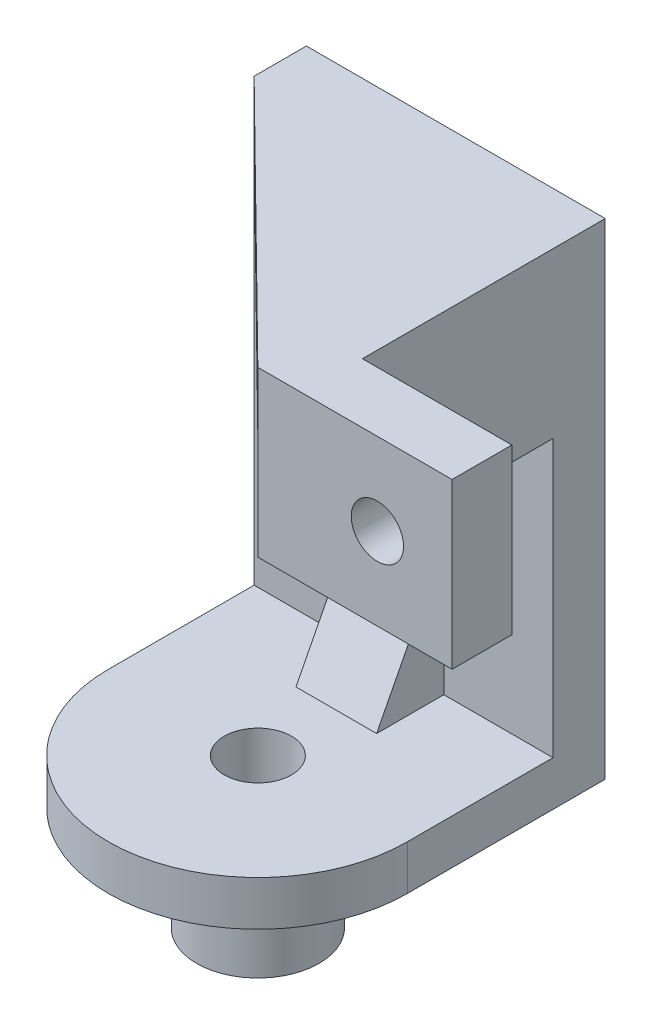
ISO-10303-21;
HEADER;
FILE_DESCRIPTION(('STEP AP214'),'2;1');
FILE_NAME('part.step','',(''),(''),'','','');
FILE_SCHEMA(('AUTOMOTIVE_DESIGN { 1 0 10303 214 1 1 1 1 }'));
ENDSEC;
DATA;
#1=APPLICATION_CONTEXT('core data for automotive mechanical design processes');
#2=APPLICATION_PROTOCOL_DEFINITION('international standard','automotive_design',2000,#1);
#3=PRODUCT_CONTEXT('',#1,'mechanical');
#4=PRODUCT('Part','Part','',(#3));
#5=PRODUCT_RELATED_PRODUCT_CATEGORY('part','',(#4));
#6=PRODUCT_DEFINITION_FORMATION('','',#4);
#7=PRODUCT_DEFINITION_CONTEXT('part definition',#1,'design');
#8=PRODUCT_DEFINITION('design','',#6,#7);
#9=PRODUCT_DEFINITION_SHAPE('','',#8);
#10=(LENGTH_UNIT() NAMED_UNIT(*) SI_UNIT(.MILLI.,.METRE.));
#11=(NAMED_UNIT(*) PLANE_ANGLE_UNIT() SI_UNIT($,.RADIAN.));
#12=(NAMED_UNIT(*) SI_UNIT($,.STERADIAN.) SOLID_ANGLE_UNIT());
#13=UNCERTAINTY_MEASURE_WITH_UNIT(LENGTH_MEASURE(1.E-05),#10,'distance_accuracy_value','');
#14=(GEOMETRIC_REPRESENTATION_CONTEXT(3) GLOBAL_UNCERTAINTY_ASSIGNED_CONTEXT((#13)) GLOBAL_UNIT_ASSIGNED_CONTEXT((#10,
#11,#12)) REPRESENTATION_CONTEXT('',''));
#15=CARTESIAN_POINT('',(0.,0.,0.));
#16=DIRECTION('',(0.,0.,1.));
#17=DIRECTION('',(1.,0.,0.));
#18=AXIS2_PLACEMENT_3D('',#15,#16,#17);
#19=CARTESIAN_POINT('',(1.28402573287201,28.,-15.9459750219353));
#20=DIRECTION('',(0.,0.,-1.));
#21=DIRECTION('',(-1.,0.,0.));
#22=AXIS2_PLACEMENT_3D('',#19,#20,#21);
#23=PLANE('',#22);
#24=CARTESIAN_POINT('',(-8.71597426712799,23.,-15.9459750219353));
#25=DIRECTION('',(0.,0.,-1.));
#26=DIRECTION('',(-1.,0.,0.));
#27=AXIS2_PLACEMENT_3D('',#24,#25,#26);
#28=CIRCLE('',#27,2.25);
#29=CARTESIAN_POINT('',(-10.965974267128,23.,-15.9459750219353));
#30=VERTEX_POINT('',#29);
#31=EDGE_CURVE('E224',#30,#30,#28,.T.);
#32=ORIENTED_EDGE('',*,*,#31,.T.);
#33=EDGE_LOOP('',(#32));
#34=FACE_BOUND('',#33,.T.);
#35=DIRECTION('',(1.,0.,0.));
#36=VECTOR('',#35,1.);
#37=CARTESIAN_POINT('',(1.28402573287201,28.5,-15.9459750219353));
#38=LINE('',#37,#36);
#39=CARTESIAN_POINT('',(-18.715974267128,28.5,-15.9459750219353));
#40=VERTEX_POINT('',#39);
#41=CARTESIAN_POINT('',(-1.71597426712799,28.5,-15.9459750219353));
#42=VERTEX_POINT('',#41);
#43=EDGE_CURVE('E166',#40,#42,#38,.T.);
#44=ORIENTED_EDGE('',*,*,#43,.F.);
#45=DIRECTION('',(0.,-1.,0.));
#46=VECTOR('',#45,1.);
#47=CARTESIAN_POINT('',(-18.715974267128,28.,-15.9459750219353));
#48=LINE('',#47,#46);
#49=CARTESIAN_POINT('',(-18.715974267128,3.,-15.9459750219353));
#50=VERTEX_POINT('',#49);
#51=EDGE_CURVE('E161',#40,#50,#48,.T.);
#52=ORIENTED_EDGE('',*,*,#51,.T.);
#53=DIRECTION('',(1.,0.,0.));
#54=VECTOR('',#53,1.);
#55=CARTESIAN_POINT('',(1.28402573287201,3.,-15.9459750219353));
#56=LINE('',#55,#54);
#57=CARTESIAN_POINT('',(-11.415974267128,3.,-15.9459750219353));
#58=VERTEX_POINT('',#57);
#59=EDGE_CURVE('E182',#50,#58,#56,.T.);
#60=ORIENTED_EDGE('',*,*,#59,.T.);
#61=DIRECTION('',(0.,1.,0.));
#62=VECTOR('',#61,1.);
#63=CARTESIAN_POINT('',(-11.415974267128,28.,-15.9459750219353));
#64=LINE('',#63,#62);
#65=CARTESIAN_POINT('',(-11.415974267128,11.75,-15.9459750219353));
#66=VERTEX_POINT('',#65);
#67=EDGE_CURVE('E319',#58,#66,#64,.T.);
#68=ORIENTED_EDGE('',*,*,#67,.T.);
#69=DIRECTION('',(-1.,0.,0.));
#70=VECTOR('',#69,1.);
#71=CARTESIAN_POINT('',(1.28402573287201,11.75,-15.9459750219353));
#72=LINE('',#71,#70);
#73=CARTESIAN_POINT('',(-6.01597426712799,11.75,-15.9459750219353));
#74=VERTEX_POINT('',#73);
#75=EDGE_CURVE('E243',#66,#74,#72,.F.);
#76=ORIENTED_EDGE('',*,*,#75,.T.);
#77=DIRECTION('',(0.,1.,0.));
#78=VECTOR('',#77,1.);
#79=CARTESIAN_POINT('',(-6.01597426712799,28.,-15.9459750219353));
#80=LINE('',#79,#78);
#81=CARTESIAN_POINT('',(-6.01597426712799,3.,-15.9459750219353));
#82=VERTEX_POINT('',#81);
#83=EDGE_CURVE('E259',#82,#74,#80,.T.);
#84=ORIENTED_EDGE('',*,*,#83,.F.);
#85=CARTESIAN_POINT('',(1.28402573287201,3.,-15.9459750219353));
#86=VERTEX_POINT('',#85);
#87=EDGE_CURVE('E249',#82,#86,#56,.T.);
#88=ORIENTED_EDGE('',*,*,#87,.T.);
#89=DIRECTION('',(0.,-1.,0.));
#90=VECTOR('',#89,1.);
#91=CARTESIAN_POINT('',(1.28402573287201,28.,-15.9459750219353));
#92=LINE('',#91,#90);
#93=CARTESIAN_POINT('',(1.28402573287201,21.5,-15.9459750219353));
#94=VERTEX_POINT('',#93);
#95=EDGE_CURVE('E180',#94,#86,#92,.T.);
#96=ORIENTED_EDGE('',*,*,#95,.F.);
#97=DIRECTION('',(1.,0.,0.));
#98=VECTOR('',#97,1.);
#99=CARTESIAN_POINT('',(1.28402573287201,21.5,-15.9459750219353));
#100=LINE('',#99,#98);
#101=CARTESIAN_POINT('',(-1.71597426712799,21.5,-15.9459750219353));
#102=VERTEX_POINT('',#101);
#103=EDGE_CURVE('E448',#102,#94,#100,.T.);
#104=ORIENTED_EDGE('',*,*,#103,.F.);
#105=DIRECTION('',(0.,-1.,0.));
#106=VECTOR('',#105,1.);
#107=CARTESIAN_POINT('',(-1.71597426712799,32.5,-15.9459750219353));
#108=LINE('',#107,#106);
#109=EDGE_CURVE('E67',#42,#102,#108,.T.);
#110=ORIENTED_EDGE('',*,*,#109,.F.);
#111=EDGE_LOOP('',(#44,#52,#60,#68,#76,#84,#88,#96,#104,#110));
#112=FACE_BOUND('',#111,.T.);
#113=ADVANCED_FACE('F41',(#34,#112),#23,.F.);
#114=CARTESIAN_POINT('',(-1.71597426712799,32.5,0.804024978064668));
#115=DIRECTION('',(1.,0.,0.));
#116=DIRECTION('',(0.,1.,0.));
#117=AXIS2_PLACEMENT_3D('',#114,#115,#116);
#118=PLANE('',#117);
#119=DIRECTION('',(0.,0.,1.));
#120=VECTOR('',#119,1.);
#121=CARTESIAN_POINT('',(-1.71597426712799,28.5,0.804024978064668));
#122=LINE('',#121,#120);
#123=CARTESIAN_POINT('',(-1.71597426712799,28.5,0.804024978064668));
#124=VERTEX_POINT('',#123);
#125=EDGE_CURVE('E167',#42,#124,#122,.T.);
#126=ORIENTED_EDGE('',*,*,#125,.F.);
#127=ORIENTED_EDGE('',*,*,#109,.T.);
#128=DIRECTION('',(0.,0.,-1.));
#129=VECTOR('',#128,1.);
#130=CARTESIAN_POINT('',(-1.71597426712799,21.5,0.804024978064668));
#131=LINE('',#130,#129);
#132=CARTESIAN_POINT('',(-1.71597426712799,21.5,0.804024978064668));
#133=VERTEX_POINT('',#132);
#134=EDGE_CURVE('E296',#133,#102,#131,.T.);
#135=ORIENTED_EDGE('',*,*,#134,.F.);
#136=DIRECTION('',(0.,-1.,0.));
#137=VECTOR('',#136,1.);
#138=CARTESIAN_POINT('',(-1.71597426712799,32.5,0.804024978064668));
#139=LINE('',#138,#137);
#140=EDGE_CURVE('E457',#124,#133,#139,.T.);
#141=ORIENTED_EDGE('',*,*,#140,.F.);
#142=EDGE_LOOP('',(#126,#127,#135,#141));
#143=FACE_BOUND('',#142,.T.);
#144=ADVANCED_FACE('F346',(#143),#118,.F.);
#145=CARTESIAN_POINT('',(1.28402573287201,3.,0.));
#146=DIRECTION('',(1.,0.,0.));
#147=DIRECTION('',(0.,0.,-1.));
#148=AXIS2_PLACEMENT_3D('',#145,#146,#147);
#149=PLANE('',#148);
#150=DIRECTION('',(0.,0.,1.));
#151=VECTOR('',#150,1.);
#152=CARTESIAN_POINT('',(1.28402573287201,32.5,-19.4459750219353));
#153=LINE('',#152,#151);
#154=CARTESIAN_POINT('',(1.28402573287201,32.5,-19.4459750219353));
#155=VERTEX_POINT('',#154);
#156=CARTESIAN_POINT('',(1.28402573287201,32.5,-3.19597502193533));
#157=VERTEX_POINT('',#156);
#158=EDGE_CURVE('E279',#155,#157,#153,.T.);
#159=ORIENTED_EDGE('',*,*,#158,.T.);
#160=DIRECTION('',(0.,1.,0.));
#161=VECTOR('',#160,1.);
#162=CARTESIAN_POINT('',(1.28402573287201,21.5,-3.19597502193533));
#163=LINE('',#162,#161);
#164=CARTESIAN_POINT('',(1.28402573287201,21.5,-3.19597502193533));
#165=VERTEX_POINT('',#164);
#166=EDGE_CURVE('E479',#165,#157,#163,.T.);
#167=ORIENTED_EDGE('',*,*,#166,.F.);
#168=DIRECTION('',(0.,0.,-1.));
#169=VECTOR('',#168,1.);
#170=CARTESIAN_POINT('',(1.28402573287201,21.5,0.804024978064668));
#171=LINE('',#170,#169);
#172=EDGE_CURVE('E300',#165,#94,#171,.T.);
#173=ORIENTED_EDGE('',*,*,#172,.T.);
#174=ORIENTED_EDGE('',*,*,#95,.T.);
#175=DIRECTION('',(0.,0.,1.));
#176=VECTOR('',#175,1.);
#177=CARTESIAN_POINT('',(1.28402573287201,3.,0.));
#178=LINE('',#177,#176);
#179=CARTESIAN_POINT('',(1.28402573287201,3.,-6.19597502193533));
#180=VERTEX_POINT('',#179);
#181=EDGE_CURVE('E197',#86,#180,#178,.T.);
#182=ORIENTED_EDGE('',*,*,#181,.T.);
#183=DIRECTION('',(0.,-1.,0.));
#184=VECTOR('',#183,1.);
#185=CARTESIAN_POINT('',(1.28402573287201,3.,-6.19597502193533));
#186=LINE('',#185,#184);
#187=CARTESIAN_POINT('',(1.28402573287201,0.,-6.19597502193533));
#188=VERTEX_POINT('',#187);
#189=EDGE_CURVE('E220',#180,#188,#186,.T.);
#190=ORIENTED_EDGE('',*,*,#189,.T.);
#191=DIRECTION('',(0.,0.,1.));
#192=VECTOR('',#191,1.);
#193=CARTESIAN_POINT('',(1.28402573287201,0.,0.));
#194=LINE('',#193,#192);
#195=CARTESIAN_POINT('',(1.28402573287201,0.,-19.4459750219353));
#196=VERTEX_POINT('',#195);
#197=EDGE_CURVE('E208',#196,#188,#194,.T.);
#198=ORIENTED_EDGE('',*,*,#197,.F.);
#199=DIRECTION('',(0.,-1.,0.));
#200=VECTOR('',#199,1.);
#201=CARTESIAN_POINT('',(1.28402573287201,3.,-19.4459750219353));
#202=LINE('',#201,#200);
#203=EDGE_CURVE('E217',#155,#196,#202,.T.);
#204=ORIENTED_EDGE('',*,*,#203,.F.);
#205=EDGE_LOOP('',(#159,#167,#173,#174,#182,#190,#198,#204));
#206=FACE_BOUND('',#205,.T.);
#207=ADVANCED_FACE('F268',(#206),#149,.T.);
#208=CARTESIAN_POINT('',(0.,0.,0.));
#209=DIRECTION('',(0.,1.,0.));
#210=DIRECTION('',(0.,0.,1.));
#211=AXIS2_PLACEMENT_3D('',#208,#209,#210);
#212=PLANE('',#211);
#213=CARTESIAN_POINT('',(-8.71597426712799,0.,-6.19597502193533));
#214=DIRECTION('',(0.,1.,0.));
#215=DIRECTION('',(0.,0.,1.));
#216=AXIS2_PLACEMENT_3D('',#213,#214,#215);
#217=CIRCLE('',#216,4.1);
#218=CARTESIAN_POINT('',(-8.71597426712799,0.,-2.09597502193533));
#219=VERTEX_POINT('',#218);
#220=EDGE_CURVE('E11',#219,#219,#217,.F.);
#221=ORIENTED_EDGE('',*,*,#220,.F.);
#222=EDGE_LOOP('',(#221));
#223=FACE_BOUND('',#222,.T.);
#224=DIRECTION('',(1.,0.,0.));
#225=VECTOR('',#224,1.);
#226=CARTESIAN_POINT('',(0.,0.,-19.4459750219353));
#227=LINE('',#226,#225);
#228=CARTESIAN_POINT('',(-18.715974267128,0.,-19.4459750219353));
#229=VERTEX_POINT('',#228);
#230=EDGE_CURVE('E193',#229,#196,#227,.T.);
#231=ORIENTED_EDGE('',*,*,#230,.T.);
#232=ORIENTED_EDGE('',*,*,#197,.T.);
#233=CARTESIAN_POINT('',(-8.71597426712799,0.,-6.19597502193533));
#234=DIRECTION('',(0.,1.,0.));
#235=DIRECTION('',(0.,0.,1.));
#236=AXIS2_PLACEMENT_3D('',#233,#234,#235);
#237=CIRCLE('',#236,10.);
#238=CARTESIAN_POINT('',(-18.715974267128,0.,-6.19597502193533));
#239=VERTEX_POINT('',#238);
#240=EDGE_CURVE('E204',#188,#239,#237,.F.);
#241=ORIENTED_EDGE('',*,*,#240,.T.);
#242=DIRECTION('',(0.,0.,1.));
#243=VECTOR('',#242,1.);
#244=CARTESIAN_POINT('',(-18.715974267128,0.,0.));
#245=LINE('',#244,#243);
#246=EDGE_CURVE('E189',#229,#239,#245,.T.);
#247=ORIENTED_EDGE('',*,*,#246,.F.);
#248=EDGE_LOOP('',(#231,#232,#241,#247));
#249=FACE_BOUND('',#248,.T.);
#250=ADVANCED_FACE('F275',(#223,#249),#212,.F.);
#251=CARTESIAN_POINT('',(-18.715974267128,3.,0.));
#252=DIRECTION('',(1.,0.,0.));
#253=DIRECTION('',(0.,0.,-1.));
#254=AXIS2_PLACEMENT_3D('',#251,#252,#253);
#255=PLANE('',#254);
#256=DIRECTION('',(0.,-1.,0.));
#257=VECTOR('',#256,1.);
#258=CARTESIAN_POINT('',(-18.715974267128,3.,-19.4459750219353));
#259=LINE('',#258,#257);
#260=CARTESIAN_POINT('',(-18.715974267128,32.5,-19.4459750219353));
#261=VERTEX_POINT('',#260);
#262=EDGE_CURVE('E200',#261,#229,#259,.T.);
#263=ORIENTED_EDGE('',*,*,#262,.T.);
#264=ORIENTED_EDGE('',*,*,#246,.T.);
#265=DIRECTION('',(0.,-1.,0.));
#266=VECTOR('',#265,1.);
#267=CARTESIAN_POINT('',(-18.715974267128,3.,-6.19597502193533));
#268=LINE('',#267,#266);
#269=CARTESIAN_POINT('',(-18.715974267128,3.,-6.19597502193533));
#270=VERTEX_POINT('',#269);
#271=EDGE_CURVE('E51',#270,#239,#268,.T.);
#272=ORIENTED_EDGE('',*,*,#271,.F.);
#273=DIRECTION('',(0.,0.,1.));
#274=VECTOR('',#273,1.);
#275=CARTESIAN_POINT('',(-18.715974267128,3.,0.));
#276=LINE('',#275,#274);
#277=EDGE_CURVE('E178',#50,#270,#276,.T.);
#278=ORIENTED_EDGE('',*,*,#277,.F.);
#279=ORIENTED_EDGE('',*,*,#51,.F.);
#280=CARTESIAN_POINT('',(-18.715974267128,32.5,-15.9459750219353));
#281=VERTEX_POINT('',#280);
#282=EDGE_CURVE('E151',#281,#40,#48,.T.);
#283=ORIENTED_EDGE('',*,*,#282,.F.);
#284=DIRECTION('',(0.,0.,1.));
#285=VECTOR('',#284,1.);
#286=CARTESIAN_POINT('',(-18.715974267128,32.5,-19.4459750219353));
#287=LINE('',#286,#285);
#288=EDGE_CURVE('E291',#261,#281,#287,.T.);
#289=ORIENTED_EDGE('',*,*,#288,.F.);
#290=EDGE_LOOP('',(#263,#264,#272,#278,#279,#283,#289));
#291=FACE_BOUND('',#290,.T.);
#292=ADVANCED_FACE('F43',(#291),#255,.F.);
#293=CARTESIAN_POINT('',(-8.71597426712799,3.,-6.19597502193533));
#294=DIRECTION('',(0.,-1.,0.));
#295=DIRECTION('',(0.,0.,-1.));
#296=AXIS2_PLACEMENT_3D('',#293,#294,#295);
#297=CYLINDRICAL_SURFACE('',#296,10.);
#298=ORIENTED_EDGE('',*,*,#240,.F.);
#299=ORIENTED_EDGE('',*,*,#189,.F.);
#300=CARTESIAN_POINT('',(-8.71597426712799,3.,-6.19597502193533));
#301=DIRECTION('',(0.,1.,0.));
#302=DIRECTION('',(0.,0.,1.));
#303=AXIS2_PLACEMENT_3D('',#300,#301,#302);
#304=CIRCLE('',#303,10.);
#305=EDGE_CURVE('E192',#180,#270,#304,.F.);
#306=ORIENTED_EDGE('',*,*,#305,.T.);
#307=ORIENTED_EDGE('',*,*,#271,.T.);
#308=EDGE_LOOP('',(#298,#299,#306,#307));
#309=FACE_BOUND('',#308,.T.);
#310=ADVANCED_FACE('F272',(#309),#297,.T.);
#311=CARTESIAN_POINT('',(0.,3.,-19.4459750219353));
#312=DIRECTION('',(0.,0.,-1.));
#313=DIRECTION('',(-1.,0.,0.));
#314=AXIS2_PLACEMENT_3D('',#311,#312,#313);
#315=PLANE('',#314);
#316=ORIENTED_EDGE('',*,*,#203,.T.);
#317=ORIENTED_EDGE('',*,*,#230,.F.);
#318=ORIENTED_EDGE('',*,*,#262,.F.);
#319=DIRECTION('',(-1.,0.,0.));
#320=VECTOR('',#319,1.);
#321=CARTESIAN_POINT('',(-18.715974267128,32.5,-19.4459750219353));
#322=LINE('',#321,#320);
#323=EDGE_CURVE('E286',#155,#261,#322,.T.);
#324=ORIENTED_EDGE('',*,*,#323,.F.);
#325=EDGE_LOOP('',(#316,#317,#318,#324));
#326=FACE_BOUND('',#325,.T.);
#327=CARTESIAN_POINT('',(-8.71597426712799,23.,-19.4459750219353));
#328=DIRECTION('',(0.,0.,-1.));
#329=DIRECTION('',(-1.,0.,0.));
#330=AXIS2_PLACEMENT_3D('',#327,#328,#329);
#331=CIRCLE('',#330,2.25);
#332=CARTESIAN_POINT('',(-10.965974267128,23.,-19.4459750219353));
#333=VERTEX_POINT('',#332);
#334=EDGE_CURVE('E228',#333,#333,#331,.T.);
#335=ORIENTED_EDGE('',*,*,#334,.F.);
#336=EDGE_LOOP('',(#335));
#337=FACE_BOUND('',#336,.T.);
#338=ADVANCED_FACE('F293',(#326,#337),#315,.T.);
#339=CARTESIAN_POINT('',(0.,3.,0.));
#340=DIRECTION('',(0.,1.,0.));
#341=DIRECTION('',(0.,0.,1.));
#342=AXIS2_PLACEMENT_3D('',#339,#340,#341);
#343=PLANE('',#342);
#344=DIRECTION('',(0.,0.,1.));
#345=VECTOR('',#344,1.);
#346=CARTESIAN_POINT('',(-11.415974267128,3.,0.));
#347=LINE('',#346,#345);
#348=CARTESIAN_POINT('',(-11.415974267128,3.,-11.4459750219353));
#349=VERTEX_POINT('',#348);
#350=EDGE_CURVE('E322',#58,#349,#347,.T.);
#351=ORIENTED_EDGE('',*,*,#350,.F.);
#352=ORIENTED_EDGE('',*,*,#59,.F.);
#353=ORIENTED_EDGE('',*,*,#277,.T.);
#354=ORIENTED_EDGE('',*,*,#305,.F.);
#355=ORIENTED_EDGE('',*,*,#181,.F.);
#356=ORIENTED_EDGE('',*,*,#87,.F.);
#357=DIRECTION('',(0.,0.,1.));
#358=VECTOR('',#357,1.);
#359=CARTESIAN_POINT('',(-6.01597426712799,3.,0.));
#360=LINE('',#359,#358);
#361=CARTESIAN_POINT('',(-6.01597426712799,3.,-11.4459750219353));
#362=VERTEX_POINT('',#361);
#363=EDGE_CURVE('E316',#82,#362,#360,.T.);
#364=ORIENTED_EDGE('',*,*,#363,.T.);
#365=DIRECTION('',(-1.,0.,0.));
#366=VECTOR('',#365,1.);
#367=CARTESIAN_POINT('',(0.,3.,-11.4459750219353));
#368=LINE('',#367,#366);
#369=EDGE_CURVE('E237',#349,#362,#368,.F.);
#370=ORIENTED_EDGE('',*,*,#369,.F.);
#371=EDGE_LOOP('',(#351,#352,#353,#354,#355,#356,#364,#370));
#372=FACE_BOUND('',#371,.T.);
#373=CARTESIAN_POINT('',(-8.71597426712799,3.,-6.19597502193533));
#374=DIRECTION('',(0.,1.,0.));
#375=DIRECTION('',(0.,0.,1.));
#376=AXIS2_PLACEMENT_3D('',#373,#374,#375);
#377=CIRCLE('',#376,2.25);
#378=CARTESIAN_POINT('',(-8.71597426712799,3.,-3.94597502193533));
#379=VERTEX_POINT('',#378);
#380=EDGE_CURVE('E160',#379,#379,#377,.T.);
#381=ORIENTED_EDGE('',*,*,#380,.F.);
#382=EDGE_LOOP('',(#381));
#383=FACE_BOUND('',#382,.T.);
#384=ADVANCED_FACE('F263',(#372,#383),#343,.T.);
#385=CARTESIAN_POINT('',(-8.71597426712799,0.,-6.19597502193533));
#386=DIRECTION('',(0.,1.,0.));
#387=DIRECTION('',(0.,0.,1.));
#388=AXIS2_PLACEMENT_3D('',#385,#386,#387);
#389=CYLINDRICAL_SURFACE('',#388,2.25);
#390=ORIENTED_EDGE('',*,*,#380,.T.);
#391=EDGE_LOOP('',(#390));
#392=FACE_BOUND('',#391,.T.);
#393=CARTESIAN_POINT('',(-8.71597426712799,-7.,-6.19597502193533));
#394=DIRECTION('',(0.,-1.,0.));
#395=DIRECTION('',(0.,0.,-1.));
#396=AXIS2_PLACEMENT_3D('',#393,#394,#395);
#397=CIRCLE('',#396,2.25);
#398=CARTESIAN_POINT('',(-8.71597426712799,-7.,-8.44597502193533));
#399=VERTEX_POINT('',#398);
#400=EDGE_CURVE('E227',#399,#399,#397,.T.);
#401=ORIENTED_EDGE('',*,*,#400,.T.);
#402=EDGE_LOOP('',(#401));
#403=FACE_BOUND('',#402,.T.);
#404=ADVANCED_FACE('F357',(#392,#403),#389,.F.);
#405=CARTESIAN_POINT('',(-8.71597426712799,-7.,-6.19597502193533));
#406=DIRECTION('',(0.,-1.,0.));
#407=DIRECTION('',(0.,0.,-1.));
#408=AXIS2_PLACEMENT_3D('',#405,#406,#407);
#409=PLANE('',#408);
#410=ORIENTED_EDGE('',*,*,#400,.F.);
#411=EDGE_LOOP('',(#410));
#412=FACE_BOUND('',#411,.T.);
#413=CARTESIAN_POINT('',(-8.71597426712799,-7.,-6.19597502193533));
#414=DIRECTION('',(0.,-1.,0.));
#415=DIRECTION('',(0.,0.,-1.));
#416=AXIS2_PLACEMENT_3D('',#413,#414,#415);
#417=CIRCLE('',#416,4.1);
#418=CARTESIAN_POINT('',(-8.71597426712799,-7.,-10.2959750219353));
#419=VERTEX_POINT('',#418);
#420=EDGE_CURVE('E234',#419,#419,#417,.T.);
#421=ORIENTED_EDGE('',*,*,#420,.T.);
#422=EDGE_LOOP('',(#421));
#423=FACE_BOUND('',#422,.T.);
#424=ADVANCED_FACE('F360',(#412,#423),#409,.T.);
#425=CARTESIAN_POINT('',(-8.71597426712799,-7.,-6.19597502193533));
#426=DIRECTION('',(0.,1.,0.));
#427=DIRECTION('',(0.,0.,1.));
#428=AXIS2_PLACEMENT_3D('',#425,#426,#427);
#429=CYLINDRICAL_SURFACE('',#428,4.1);
#430=ORIENTED_EDGE('',*,*,#220,.T.);
#431=EDGE_LOOP('',(#430));
#432=FACE_BOUND('',#431,.T.);
#433=ORIENTED_EDGE('',*,*,#420,.F.);
#434=EDGE_LOOP('',(#433));
#435=FACE_BOUND('',#434,.T.);
#436=ADVANCED_FACE('F355',(#432,#435),#429,.T.);
#437=CARTESIAN_POINT('',(-8.71597426712799,23.,3.55402497806468));
#438=DIRECTION('',(0.,0.,-1.));
#439=DIRECTION('',(-1.,0.,0.));
#440=AXIS2_PLACEMENT_3D('',#437,#438,#439);
#441=CYLINDRICAL_SURFACE('',#440,2.25);
#442=ORIENTED_EDGE('',*,*,#334,.T.);
#443=EDGE_LOOP('',(#442));
#444=FACE_BOUND('',#443,.T.);
#445=ORIENTED_EDGE('',*,*,#31,.F.);
#446=EDGE_LOOP('',(#445));
#447=FACE_BOUND('',#446,.T.);
#448=ADVANCED_FACE('F342',(#444,#447),#441,.F.);
#449=CARTESIAN_POINT('',(-8.715974267128,11.75,-15.9459750219353));
#450=DIRECTION('',(0.,-0.457348012620761,-0.889287802318147));
#451=DIRECTION('',(0.,-0.889287802318147,0.457348012620761));
#452=AXIS2_PLACEMENT_3D('',#449,#450,#451);
#453=PLANE('',#452);
#454=DIRECTION('',(0.,-0.889287802318147,0.457348012620761));
#455=VECTOR('',#454,1.);
#456=CARTESIAN_POINT('',(-11.415974267128,11.75,-15.9459750219353));
#457=LINE('',#456,#455);
#458=EDGE_CURVE('E307',#66,#349,#457,.T.);
#459=ORIENTED_EDGE('',*,*,#458,.T.);
#460=ORIENTED_EDGE('',*,*,#369,.T.);
#461=DIRECTION('',(0.,-0.889287802318147,0.457348012620761));
#462=VECTOR('',#461,1.);
#463=CARTESIAN_POINT('',(-6.01597426712799,11.75,-15.9459750219353));
#464=LINE('',#463,#462);
#465=EDGE_CURVE('E305',#74,#362,#464,.T.);
#466=ORIENTED_EDGE('',*,*,#465,.F.);
#467=ORIENTED_EDGE('',*,*,#75,.F.);
#468=EDGE_LOOP('',(#459,#460,#466,#467));
#469=FACE_BOUND('',#468,.T.);
#470=ADVANCED_FACE('F332',(#469),#453,.F.);
#471=CARTESIAN_POINT('',(-11.415974267128,10.5,-7.82097502193533));
#472=DIRECTION('',(-1.,0.,0.));
#473=DIRECTION('',(0.,0.,1.));
#474=AXIS2_PLACEMENT_3D('',#471,#472,#473);
#475=PLANE('',#474);
#476=ORIENTED_EDGE('',*,*,#458,.F.);
#477=ORIENTED_EDGE('',*,*,#67,.F.);
#478=ORIENTED_EDGE('',*,*,#350,.T.);
#479=EDGE_LOOP('',(#476,#477,#478));
#480=FACE_BOUND('',#479,.T.);
#481=ADVANCED_FACE('F334',(#480),#475,.T.);
#482=CARTESIAN_POINT('',(-6.01597426712799,10.5,-7.82097502193533));
#483=DIRECTION('',(-1.,0.,0.));
#484=DIRECTION('',(0.,0.,1.));
#485=AXIS2_PLACEMENT_3D('',#482,#483,#484);
#486=PLANE('',#485);
#487=ORIENTED_EDGE('',*,*,#363,.F.);
#488=ORIENTED_EDGE('',*,*,#83,.T.);
#489=ORIENTED_EDGE('',*,*,#465,.T.);
#490=EDGE_LOOP('',(#487,#488,#489));
#491=FACE_BOUND('',#490,.T.);
#492=ADVANCED_FACE('F331',(#491),#486,.F.);
#493=CARTESIAN_POINT('',(-18.715974267128,32.5,-19.4459750219353));
#494=DIRECTION('',(0.,1.,0.));
#495=DIRECTION('',(0.,0.,1.));
#496=AXIS2_PLACEMENT_3D('',#493,#494,#495);
#497=PLANE('',#496);
#498=ORIENTED_EDGE('',*,*,#288,.T.);
#499=DIRECTION('',(-0.712325066937561,0.,-0.701849698306126));
#500=VECTOR('',#499,1.);
#501=CARTESIAN_POINT('',(-1.71597426712799,32.5,0.804024978064668));
#502=LINE('',#501,#500);
#503=CARTESIAN_POINT('',(-1.71597426712799,32.5,0.804024978064668));
#504=VERTEX_POINT('',#503);
#505=EDGE_CURVE('E154',#504,#281,#502,.T.);
#506=ORIENTED_EDGE('',*,*,#505,.F.);
#507=DIRECTION('',(-1.,0.,0.));
#508=VECTOR('',#507,1.);
#509=CARTESIAN_POINT('',(1.28402573287201,32.5,0.804024978064668));
#510=LINE('',#509,#508);
#511=CARTESIAN_POINT('',(11.284025732872,32.5,0.804024978064667));
#512=VERTEX_POINT('',#511);
#513=EDGE_CURVE('E452',#512,#504,#510,.T.);
#514=ORIENTED_EDGE('',*,*,#513,.F.);
#515=DIRECTION('',(0.,0.,1.));
#516=VECTOR('',#515,1.);
#517=CARTESIAN_POINT('',(11.284025732872,32.5,0.804024978064667));
#518=LINE('',#517,#516);
#519=CARTESIAN_POINT('',(11.284025732872,32.5,-3.19597502193533));
#520=VERTEX_POINT('',#519);
#521=EDGE_CURVE('E478',#520,#512,#518,.T.);
#522=ORIENTED_EDGE('',*,*,#521,.F.);
#523=DIRECTION('',(-1.,0.,0.));
#524=VECTOR('',#523,1.);
#525=CARTESIAN_POINT('',(11.284025732872,32.5,-3.19597502193533));
#526=LINE('',#525,#524);
#527=EDGE_CURVE('E289',#520,#157,#526,.T.);
#528=ORIENTED_EDGE('',*,*,#527,.T.);
#529=ORIENTED_EDGE('',*,*,#158,.F.);
#530=ORIENTED_EDGE('',*,*,#323,.T.);
#531=EDGE_LOOP('',(#498,#506,#514,#522,#528,#529,#530));
#532=FACE_BOUND('',#531,.T.);
#533=ADVANCED_FACE('F285',(#532),#497,.T.);
#534=CARTESIAN_POINT('',(1.28402573287201,21.5,0.804024978064668));
#535=DIRECTION('',(0.,1.,0.));
#536=DIRECTION('',(0.,0.,1.));
#537=AXIS2_PLACEMENT_3D('',#534,#535,#536);
#538=PLANE('',#537);
#539=ORIENTED_EDGE('',*,*,#103,.T.);
#540=ORIENTED_EDGE('',*,*,#172,.F.);
#541=DIRECTION('',(-1.,0.,0.));
#542=VECTOR('',#541,1.);
#543=CARTESIAN_POINT('',(11.284025732872,21.5,-3.19597502193533));
#544=LINE('',#543,#542);
#545=CARTESIAN_POINT('',(11.284025732872,21.5,-3.19597502193533));
#546=VERTEX_POINT('',#545);
#547=EDGE_CURVE('E459',#546,#165,#544,.T.);
#548=ORIENTED_EDGE('',*,*,#547,.F.);
#549=DIRECTION('',(0.,0.,-1.));
#550=VECTOR('',#549,1.);
#551=CARTESIAN_POINT('',(11.284025732872,21.5,0.804024978064667));
#552=LINE('',#551,#550);
#553=CARTESIAN_POINT('',(11.284025732872,21.5,0.804024978064667));
#554=VERTEX_POINT('',#553);
#555=EDGE_CURVE('E490',#554,#546,#552,.T.);
#556=ORIENTED_EDGE('',*,*,#555,.F.);
#557=DIRECTION('',(1.,0.,0.));
#558=VECTOR('',#557,1.);
#559=CARTESIAN_POINT('',(1.28402573287201,21.5,0.804024978064668));
#560=LINE('',#559,#558);
#561=EDGE_CURVE('E463',#133,#554,#560,.T.);
#562=ORIENTED_EDGE('',*,*,#561,.F.);
#563=ORIENTED_EDGE('',*,*,#134,.T.);
#564=EDGE_LOOP('',(#539,#540,#548,#556,#562,#563));
#565=FACE_BOUND('',#564,.T.);
#566=ADVANCED_FACE('F389',(#565),#538,.F.);
#567=CARTESIAN_POINT('',(0.,0.,0.804024978064668));
#568=DIRECTION('',(0.,0.,-1.));
#569=DIRECTION('',(-1.,0.,0.));
#570=AXIS2_PLACEMENT_3D('',#567,#568,#569);
#571=PLANE('',#570);
#572=CARTESIAN_POINT('',(6.28402573287201,27.,0.804024978064668));
#573=DIRECTION('',(0.,0.,-1.));
#574=DIRECTION('',(-1.,0.,0.));
#575=AXIS2_PLACEMENT_3D('',#572,#573,#574);
#576=CIRCLE('',#575,1.75);
#577=CARTESIAN_POINT('',(4.53402573287201,27.,0.804024978064668));
#578=VERTEX_POINT('',#577);
#579=EDGE_CURVE('E483',#578,#578,#576,.F.);
#580=ORIENTED_EDGE('',*,*,#579,.F.);
#581=EDGE_LOOP('',(#580));
#582=FACE_BOUND('',#581,.T.);
#583=EDGE_CURVE('E466',#504,#124,#139,.T.);
#584=ORIENTED_EDGE('',*,*,#583,.T.);
#585=ORIENTED_EDGE('',*,*,#140,.T.);
#586=ORIENTED_EDGE('',*,*,#561,.T.);
#587=DIRECTION('',(0.,-1.,0.));
#588=VECTOR('',#587,1.);
#589=CARTESIAN_POINT('',(11.284025732872,21.5,0.804024978064667));
#590=LINE('',#589,#588);
#591=EDGE_CURVE('E482',#512,#554,#590,.T.);
#592=ORIENTED_EDGE('',*,*,#591,.F.);
#593=ORIENTED_EDGE('',*,*,#513,.T.);
#594=EDGE_LOOP('',(#584,#585,#586,#592,#593));
#595=FACE_BOUND('',#594,.T.);
#596=ADVANCED_FACE('F397',(#582,#595),#571,.F.);
#597=CARTESIAN_POINT('',(11.284025732872,21.5,-3.19597502193533));
#598=DIRECTION('',(0.,0.,1.));
#599=DIRECTION('',(1.,0.,0.));
#600=AXIS2_PLACEMENT_3D('',#597,#598,#599);
#601=PLANE('',#600);
#602=CARTESIAN_POINT('',(6.28402573287201,27.,-3.19597502193533));
#603=DIRECTION('',(0.,0.,1.));
#604=DIRECTION('',(1.,0.,0.));
#605=AXIS2_PLACEMENT_3D('',#602,#603,#604);
#606=CIRCLE('',#605,1.75);
#607=CARTESIAN_POINT('',(8.03402573287201,27.,-3.19597502193533));
#608=VERTEX_POINT('',#607);
#609=EDGE_CURVE('E45',#608,#608,#606,.F.);
#610=ORIENTED_EDGE('',*,*,#609,.F.);
#611=EDGE_LOOP('',(#610));
#612=FACE_BOUND('',#611,.T.);
#613=ORIENTED_EDGE('',*,*,#527,.F.);
#614=DIRECTION('',(0.,1.,0.));
#615=VECTOR('',#614,1.);
#616=CARTESIAN_POINT('',(11.284025732872,21.5,-3.19597502193533));
#617=LINE('',#616,#615);
#618=EDGE_CURVE('E487',#546,#520,#617,.T.);
#619=ORIENTED_EDGE('',*,*,#618,.F.);
#620=ORIENTED_EDGE('',*,*,#547,.T.);
#621=ORIENTED_EDGE('',*,*,#166,.T.);
#622=EDGE_LOOP('',(#613,#619,#620,#621));
#623=FACE_BOUND('',#622,.T.);
#624=ADVANCED_FACE('F401',(#612,#623),#601,.F.);
#625=CARTESIAN_POINT('',(11.284025732872,0.,0.));
#626=DIRECTION('',(-1.,0.,0.));
#627=DIRECTION('',(0.,0.,1.));
#628=AXIS2_PLACEMENT_3D('',#625,#626,#627);
#629=PLANE('',#628);
#630=ORIENTED_EDGE('',*,*,#591,.T.);
#631=ORIENTED_EDGE('',*,*,#555,.T.);
#632=ORIENTED_EDGE('',*,*,#618,.T.);
#633=ORIENTED_EDGE('',*,*,#521,.T.);
#634=EDGE_LOOP('',(#630,#631,#632,#633));
#635=FACE_BOUND('',#634,.T.);
#636=ADVANCED_FACE('F410',(#635),#629,.F.);
#637=CARTESIAN_POINT('',(6.28402573287201,27.,8.05402497806467));
#638=DIRECTION('',(0.,0.,-1.));
#639=DIRECTION('',(-1.,0.,0.));
#640=AXIS2_PLACEMENT_3D('',#637,#638,#639);
#641=CYLINDRICAL_SURFACE('',#640,1.75);
#642=ORIENTED_EDGE('',*,*,#609,.T.);
#643=EDGE_LOOP('',(#642));
#644=FACE_BOUND('',#643,.T.);
#645=ORIENTED_EDGE('',*,*,#579,.T.);
#646=EDGE_LOOP('',(#645));
#647=FACE_BOUND('',#646,.T.);
#648=ADVANCED_FACE('F418',(#644,#647),#641,.F.);
#649=CARTESIAN_POINT('',(-3.71597426712799,28.5,-7.82097502193533));
#650=DIRECTION('',(0.,1.,0.));
#651=DIRECTION('',(0.,0.,1.));
#652=AXIS2_PLACEMENT_3D('',#649,#650,#651);
#653=PLANE('',#652);
#654=DIRECTION('',(-0.712325066937561,0.,-0.701849698306126));
#655=VECTOR('',#654,1.);
#656=CARTESIAN_POINT('',(-1.71597426712799,28.5,0.804024978064668));
#657=LINE('',#656,#655);
#658=EDGE_CURVE('E59',#124,#40,#657,.T.);
#659=ORIENTED_EDGE('',*,*,#658,.T.);
#660=ORIENTED_EDGE('',*,*,#43,.T.);
#661=ORIENTED_EDGE('',*,*,#125,.T.);
#662=EDGE_LOOP('',(#659,#660,#661));
#663=FACE_BOUND('',#662,.T.);
#664=ADVANCED_FACE('F165',(#663),#653,.F.);
#665=CARTESIAN_POINT('',(-1.71597426712799,32.5,0.804024978064668));
#666=DIRECTION('',(0.701849698306126,0.,-0.712325066937561));
#667=DIRECTION('',(-0.712325066937561,0.,-0.701849698306126));
#668=AXIS2_PLACEMENT_3D('',#665,#666,#667);
#669=PLANE('',#668);
#670=ORIENTED_EDGE('',*,*,#505,.T.);
#671=ORIENTED_EDGE('',*,*,#282,.T.);
#672=ORIENTED_EDGE('',*,*,#658,.F.);
#673=ORIENTED_EDGE('',*,*,#583,.F.);
#674=EDGE_LOOP('',(#670,#671,#672,#673));
#675=FACE_BOUND('',#674,.T.);
#676=ADVANCED_FACE('F152',(#675),#669,.F.);
#677=CLOSED_SHELL('',(#113,#144,#207,#250,#292,#310,#338,#384,#404,#424,#436,#448,#470,#481,
#492,#533,#566,#596,#624,#636,#648,#664,#676));
#678=MANIFOLD_SOLID_BREP('B2',#677);
#679=ADVANCED_BREP_SHAPE_REPRESENTATION('',(#18,#678),#14);
#680=SHAPE_DEFINITION_REPRESENTATION(#9,#679);
ENDSEC;
END-ISO-10303-21;
